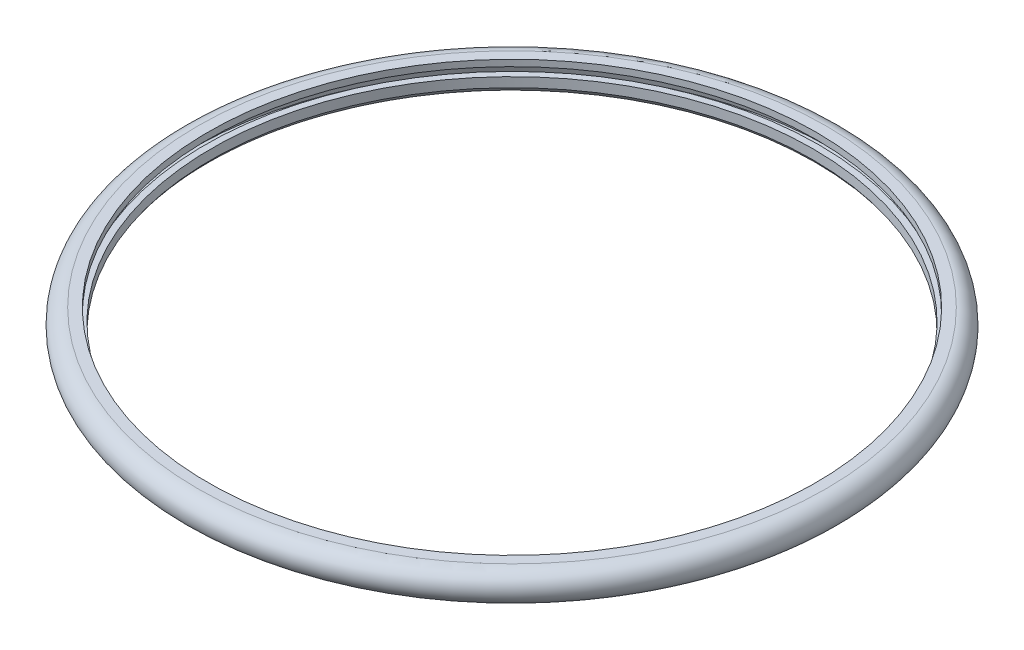
ISO-10303-21;
HEADER;
FILE_DESCRIPTION(('STEP AP214'),'2;1');
FILE_NAME('part.step','',(''),(''),'','','');
FILE_SCHEMA(('AUTOMOTIVE_DESIGN { 1 0 10303 214 1 1 1 1 }'));
ENDSEC;
DATA;
#1=APPLICATION_CONTEXT('core data for automotive mechanical design processes');
#2=APPLICATION_PROTOCOL_DEFINITION('international standard','automotive_design',2000,#1);
#3=PRODUCT_CONTEXT('',#1,'mechanical');
#4=PRODUCT('Part','Part','',(#3));
#5=PRODUCT_RELATED_PRODUCT_CATEGORY('part','',(#4));
#6=PRODUCT_DEFINITION_FORMATION('','',#4);
#7=PRODUCT_DEFINITION_CONTEXT('part definition',#1,'design');
#8=PRODUCT_DEFINITION('design','',#6,#7);
#9=PRODUCT_DEFINITION_SHAPE('','',#8);
#10=(LENGTH_UNIT() NAMED_UNIT(*) SI_UNIT(.MILLI.,.METRE.));
#11=(NAMED_UNIT(*) PLANE_ANGLE_UNIT() SI_UNIT($,.RADIAN.));
#12=(NAMED_UNIT(*) SI_UNIT($,.STERADIAN.) SOLID_ANGLE_UNIT());
#13=UNCERTAINTY_MEASURE_WITH_UNIT(LENGTH_MEASURE(1.E-05),#10,'distance_accuracy_value','');
#14=(GEOMETRIC_REPRESENTATION_CONTEXT(3) GLOBAL_UNCERTAINTY_ASSIGNED_CONTEXT((#13)) GLOBAL_UNIT_ASSIGNED_CONTEXT((#10,
#11,#12)) REPRESENTATION_CONTEXT('',''));
#15=CARTESIAN_POINT('',(0.,0.,0.));
#16=DIRECTION('',(0.,0.,1.));
#17=DIRECTION('',(1.,0.,0.));
#18=AXIS2_PLACEMENT_3D('',#15,#16,#17);
#19=CARTESIAN_POINT('',(-25.,0.,0.));
#20=DIRECTION('',(0.,-1.,0.));
#21=DIRECTION('',(0.,0.,-1.));
#22=AXIS2_PLACEMENT_3D('',#19,#20,#21);
#23=PLANE('',#22);
#24=CARTESIAN_POINT('',(0.,0.,0.));
#25=DIRECTION('',(0.,-1.,0.));
#26=DIRECTION('',(0.,0.,-1.));
#27=AXIS2_PLACEMENT_3D('',#24,#25,#26);
#28=CIRCLE('',#27,25.);
#29=CARTESIAN_POINT('',(0.,0.,-25.));
#30=VERTEX_POINT('',#29);
#31=EDGE_CURVE('E10',#30,#30,#28,.T.);
#32=ORIENTED_EDGE('',*,*,#31,.F.);
#33=EDGE_LOOP('',(#32));
#34=FACE_BOUND('',#33,.T.);
#35=CARTESIAN_POINT('',(0.,0.,0.));
#36=DIRECTION('',(0.,-1.,0.));
#37=DIRECTION('',(0.,0.,-1.));
#38=AXIS2_PLACEMENT_3D('',#35,#36,#37);
#39=CIRCLE('',#38,24.);
#40=CARTESIAN_POINT('',(0.,0.,-24.));
#41=VERTEX_POINT('',#40);
#42=EDGE_CURVE('E68',#41,#41,#39,.T.);
#43=ORIENTED_EDGE('',*,*,#42,.T.);
#44=EDGE_LOOP('',(#43));
#45=FACE_BOUND('',#44,.T.);
#46=ADVANCED_FACE('F37',(#34,#45),#23,.F.);
#47=CARTESIAN_POINT('',(0.,0.,0.));
#48=DIRECTION('',(0.,-1.,0.));
#49=DIRECTION('',(0.,0.,-1.));
#50=AXIS2_PLACEMENT_3D('',#47,#48,#49);
#51=CONICAL_SURFACE('',#50,25.,0.244978663126864);
#52=CARTESIAN_POINT('',(0.,1.25,0.));
#53=DIRECTION('',(0.,-1.,0.));
#54=DIRECTION('',(0.,0.,-1.));
#55=AXIS2_PLACEMENT_3D('',#52,#53,#54);
#56=CIRCLE('',#55,24.6875);
#57=CARTESIAN_POINT('',(0.,1.25,-24.6875));
#58=VERTEX_POINT('',#57);
#59=EDGE_CURVE('E43',#58,#58,#56,.T.);
#60=ORIENTED_EDGE('',*,*,#59,.F.);
#61=EDGE_LOOP('',(#60));
#62=FACE_BOUND('',#61,.T.);
#63=ORIENTED_EDGE('',*,*,#31,.T.);
#64=EDGE_LOOP('',(#63));
#65=FACE_BOUND('',#64,.T.);
#66=ADVANCED_FACE('F111',(#62,#65),#51,.F.);
#67=CARTESIAN_POINT('',(-24.6875,1.25,0.));
#68=DIRECTION('',(0.,1.,0.));
#69=DIRECTION('',(0.,0.,1.));
#70=AXIS2_PLACEMENT_3D('',#67,#68,#69);
#71=PLANE('',#70);
#72=CARTESIAN_POINT('',(0.,1.25,0.));
#73=DIRECTION('',(0.,-1.,0.));
#74=DIRECTION('',(0.,0.,-1.));
#75=AXIS2_PLACEMENT_3D('',#72,#73,#74);
#76=CIRCLE('',#75,23.75);
#77=CARTESIAN_POINT('',(0.,1.25,-23.75));
#78=VERTEX_POINT('',#77);
#79=EDGE_CURVE('E47',#78,#78,#76,.T.);
#80=ORIENTED_EDGE('',*,*,#79,.F.);
#81=EDGE_LOOP('',(#80));
#82=FACE_BOUND('',#81,.T.);
#83=ORIENTED_EDGE('',*,*,#59,.T.);
#84=EDGE_LOOP('',(#83));
#85=FACE_BOUND('',#84,.T.);
#86=ADVANCED_FACE('F106',(#82,#85),#71,.F.);
#87=CARTESIAN_POINT('',(0.,0.,0.));
#88=DIRECTION('',(0.,-1.,0.));
#89=DIRECTION('',(0.,0.,-1.));
#90=AXIS2_PLACEMENT_3D('',#87,#88,#89);
#91=CYLINDRICAL_SURFACE('',#90,23.75);
#92=CARTESIAN_POINT('',(0.,1.75,0.));
#93=DIRECTION('',(0.,-1.,0.));
#94=DIRECTION('',(0.,0.,-1.));
#95=AXIS2_PLACEMENT_3D('',#92,#93,#94);
#96=CIRCLE('',#95,23.75);
#97=CARTESIAN_POINT('',(0.,1.75,-23.75));
#98=VERTEX_POINT('',#97);
#99=EDGE_CURVE('E51',#98,#98,#96,.T.);
#100=ORIENTED_EDGE('',*,*,#99,.F.);
#101=EDGE_LOOP('',(#100));
#102=FACE_BOUND('',#101,.T.);
#103=ORIENTED_EDGE('',*,*,#79,.T.);
#104=EDGE_LOOP('',(#103));
#105=FACE_BOUND('',#104,.T.);
#106=ADVANCED_FACE('F100',(#102,#105),#91,.F.);
#107=CARTESIAN_POINT('',(-24.5625,1.75,0.));
#108=DIRECTION('',(0.,-1.,0.));
#109=DIRECTION('',(0.,0.,-1.));
#110=AXIS2_PLACEMENT_3D('',#107,#108,#109);
#111=PLANE('',#110);
#112=CARTESIAN_POINT('',(0.,1.75,0.));
#113=DIRECTION('',(0.,-1.,0.));
#114=DIRECTION('',(0.,0.,-1.));
#115=AXIS2_PLACEMENT_3D('',#112,#113,#114);
#116=CIRCLE('',#115,24.5625);
#117=CARTESIAN_POINT('',(0.,1.75,-24.5625));
#118=VERTEX_POINT('',#117);
#119=EDGE_CURVE('E56',#118,#118,#116,.T.);
#120=ORIENTED_EDGE('',*,*,#119,.F.);
#121=EDGE_LOOP('',(#120));
#122=FACE_BOUND('',#121,.T.);
#123=ORIENTED_EDGE('',*,*,#99,.T.);
#124=EDGE_LOOP('',(#123));
#125=FACE_BOUND('',#124,.T.);
#126=ADVANCED_FACE('F94',(#122,#125),#111,.F.);
#127=CARTESIAN_POINT('',(0.,0.552455357142856,0.));
#128=DIRECTION('',(0.,-1.,0.));
#129=DIRECTION('',(0.,0.,-1.));
#130=AXIS2_PLACEMENT_3D('',#127,#128,#129);
#131=TOROIDAL_SURFACE('',#130,24.5625,1.19754464285715);
#132=CARTESIAN_POINT('',(0.,0.,0.));
#133=DIRECTION('',(0.,-1.,0.));
#134=DIRECTION('',(0.,0.,-1.));
#135=AXIS2_PLACEMENT_3D('',#132,#133,#134);
#136=CIRCLE('',#135,23.5);
#137=CARTESIAN_POINT('',(0.,0.,-23.5));
#138=VERTEX_POINT('',#137);
#139=EDGE_CURVE('E59',#138,#138,#136,.T.);
#140=ORIENTED_EDGE('',*,*,#139,.F.);
#141=EDGE_LOOP('',(#140));
#142=FACE_BOUND('',#141,.T.);
#143=ORIENTED_EDGE('',*,*,#119,.T.);
#144=EDGE_LOOP('',(#143));
#145=FACE_BOUND('',#144,.T.);
#146=ADVANCED_FACE('F88',(#142,#145),#131,.T.);
#147=CARTESIAN_POINT('',(0.,0.,0.));
#148=DIRECTION('',(0.,-1.,0.));
#149=DIRECTION('',(0.,0.,-1.));
#150=AXIS2_PLACEMENT_3D('',#147,#148,#149);
#151=CYLINDRICAL_SURFACE('',#150,23.5);
#152=CARTESIAN_POINT('',(0.,0.749999999999999,0.));
#153=DIRECTION('',(0.,-1.,0.));
#154=DIRECTION('',(0.,0.,-1.));
#155=AXIS2_PLACEMENT_3D('',#152,#153,#154);
#156=CIRCLE('',#155,23.5);
#157=CARTESIAN_POINT('',(0.,0.749999999999999,-23.5));
#158=VERTEX_POINT('',#157);
#159=EDGE_CURVE('E62',#158,#158,#156,.T.);
#160=ORIENTED_EDGE('',*,*,#159,.F.);
#161=EDGE_LOOP('',(#160));
#162=FACE_BOUND('',#161,.T.);
#163=ORIENTED_EDGE('',*,*,#139,.T.);
#164=EDGE_LOOP('',(#163));
#165=FACE_BOUND('',#164,.T.);
#166=ADVANCED_FACE('F82',(#162,#165),#151,.F.);
#167=CARTESIAN_POINT('',(-24.,0.749999999999999,0.));
#168=DIRECTION('',(0.,-1.,0.));
#169=DIRECTION('',(0.,0.,-1.));
#170=AXIS2_PLACEMENT_3D('',#167,#168,#169);
#171=PLANE('',#170);
#172=CARTESIAN_POINT('',(0.,0.749999999999999,0.));
#173=DIRECTION('',(0.,-1.,0.));
#174=DIRECTION('',(0.,0.,-1.));
#175=AXIS2_PLACEMENT_3D('',#172,#173,#174);
#176=CIRCLE('',#175,24.);
#177=CARTESIAN_POINT('',(0.,0.749999999999999,-24.));
#178=VERTEX_POINT('',#177);
#179=EDGE_CURVE('E65',#178,#178,#176,.T.);
#180=ORIENTED_EDGE('',*,*,#179,.F.);
#181=EDGE_LOOP('',(#180));
#182=FACE_BOUND('',#181,.T.);
#183=ORIENTED_EDGE('',*,*,#159,.T.);
#184=EDGE_LOOP('',(#183));
#185=FACE_BOUND('',#184,.T.);
#186=ADVANCED_FACE('F76',(#182,#185),#171,.F.);
#187=CARTESIAN_POINT('',(0.,0.,0.));
#188=DIRECTION('',(0.,-1.,0.));
#189=DIRECTION('',(0.,0.,-1.));
#190=AXIS2_PLACEMENT_3D('',#187,#188,#189);
#191=CYLINDRICAL_SURFACE('',#190,24.);
#192=ORIENTED_EDGE('',*,*,#42,.F.);
#193=EDGE_LOOP('',(#192));
#194=FACE_BOUND('',#193,.T.);
#195=ORIENTED_EDGE('',*,*,#179,.T.);
#196=EDGE_LOOP('',(#195));
#197=FACE_BOUND('',#196,.T.);
#198=ADVANCED_FACE('F73',(#194,#197),#191,.T.);
#199=CLOSED_SHELL('',(#46,#66,#86,#106,#126,#146,#166,#186,#198));
#200=MANIFOLD_SOLID_BREP('B2',#199);
#201=ADVANCED_BREP_SHAPE_REPRESENTATION('',(#18,#200),#14);
#202=SHAPE_DEFINITION_REPRESENTATION(#9,#201);
ENDSEC;
END-ISO-10303-21;
